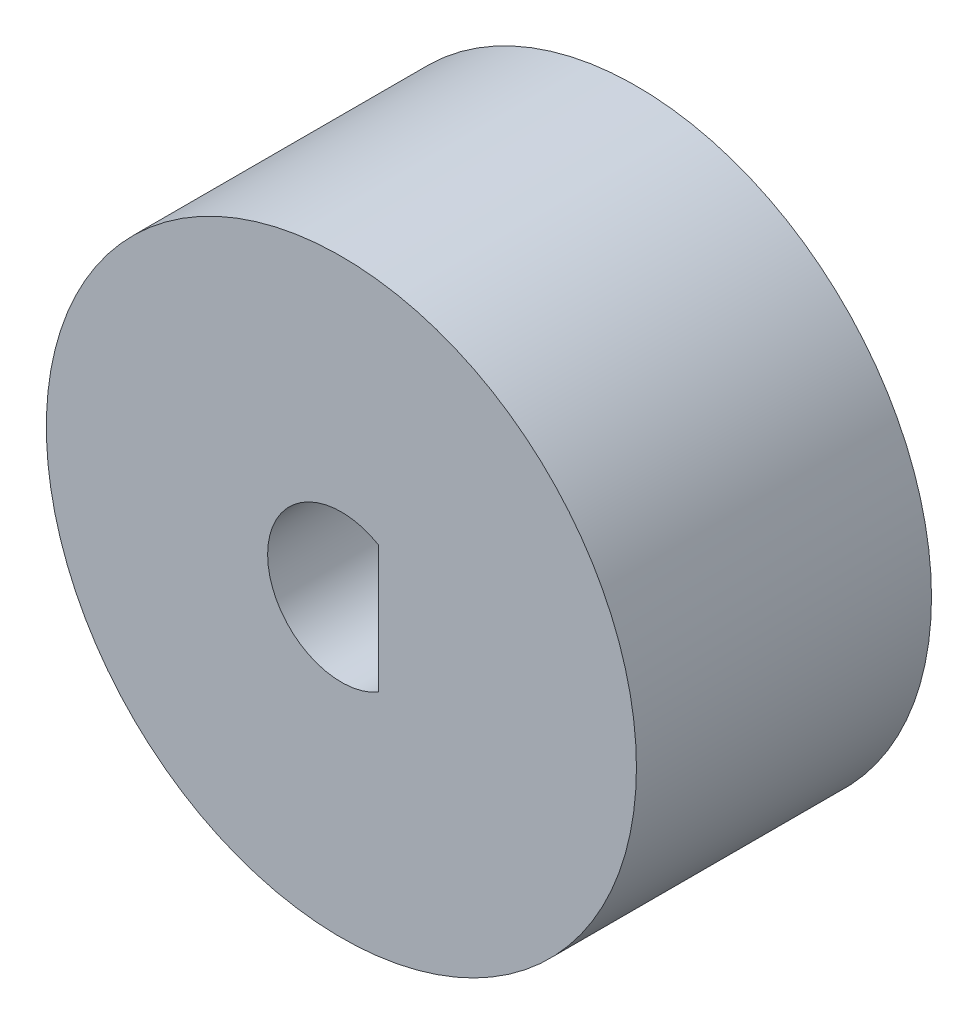
ISO-10303-21;
HEADER;
FILE_DESCRIPTION(('STEP AP214'),'2;1');
FILE_NAME('part.step','',(''),(''),'','','');
FILE_SCHEMA(('AUTOMOTIVE_DESIGN { 1 0 10303 214 1 1 1 1 }'));
ENDSEC;
DATA;
#1=APPLICATION_CONTEXT('core data for automotive mechanical design processes');
#2=APPLICATION_PROTOCOL_DEFINITION('international standard','automotive_design',2000,#1);
#3=PRODUCT_CONTEXT('',#1,'mechanical');
#4=PRODUCT('Part','Part','',(#3));
#5=PRODUCT_RELATED_PRODUCT_CATEGORY('part','',(#4));
#6=PRODUCT_DEFINITION_FORMATION('','',#4);
#7=PRODUCT_DEFINITION_CONTEXT('part definition',#1,'design');
#8=PRODUCT_DEFINITION('design','',#6,#7);
#9=PRODUCT_DEFINITION_SHAPE('','',#8);
#10=(LENGTH_UNIT() NAMED_UNIT(*) SI_UNIT(.MILLI.,.METRE.));
#11=(NAMED_UNIT(*) PLANE_ANGLE_UNIT() SI_UNIT($,.RADIAN.));
#12=(NAMED_UNIT(*) SI_UNIT($,.STERADIAN.) SOLID_ANGLE_UNIT());
#13=UNCERTAINTY_MEASURE_WITH_UNIT(LENGTH_MEASURE(1.E-05),#10,'distance_accuracy_value','');
#14=(GEOMETRIC_REPRESENTATION_CONTEXT(3) GLOBAL_UNCERTAINTY_ASSIGNED_CONTEXT((#13)) GLOBAL_UNIT_ASSIGNED_CONTEXT((#10,
#11,#12)) REPRESENTATION_CONTEXT('',''));
#15=CARTESIAN_POINT('',(0.,0.,0.));
#16=DIRECTION('',(0.,0.,1.));
#17=DIRECTION('',(1.,0.,0.));
#18=AXIS2_PLACEMENT_3D('',#15,#16,#17);
#19=CARTESIAN_POINT('',(0.,0.,50.8));
#20=DIRECTION('',(0.,0.,-1.));
#21=DIRECTION('',(-1.,0.,0.));
#22=AXIS2_PLACEMENT_3D('',#19,#20,#21);
#23=CYLINDRICAL_SURFACE('',#22,12.7);
#24=CARTESIAN_POINT('',(0.,0.,0.));
#25=DIRECTION('',(0.,0.,1.));
#26=DIRECTION('',(1.,0.,0.));
#27=AXIS2_PLACEMENT_3D('',#24,#25,#26);
#28=CIRCLE('',#27,12.7);
#29=CARTESIAN_POINT('',(6.35,10.9985226280624,0.));
#30=VERTEX_POINT('',#29);
#31=CARTESIAN_POINT('',(6.35,-10.9985226280624,0.));
#32=VERTEX_POINT('',#31);
#33=EDGE_CURVE('E63',#30,#32,#28,.T.);
#34=ORIENTED_EDGE('',*,*,#33,.F.);
#35=DIRECTION('',(0.,0.,-1.));
#36=VECTOR('',#35,1.);
#37=CARTESIAN_POINT('',(6.35,10.9985226280624,50.8));
#38=LINE('',#37,#36);
#39=CARTESIAN_POINT('',(6.35,10.9985226280624,50.8));
#40=VERTEX_POINT('',#39);
#41=EDGE_CURVE('E11',#40,#30,#38,.T.);
#42=ORIENTED_EDGE('',*,*,#41,.F.);
#43=CARTESIAN_POINT('',(0.,0.,50.8));
#44=DIRECTION('',(0.,0.,1.));
#45=DIRECTION('',(1.,0.,0.));
#46=AXIS2_PLACEMENT_3D('',#43,#44,#45);
#47=CIRCLE('',#46,12.7);
#48=CARTESIAN_POINT('',(6.35,-10.9985226280624,50.8));
#49=VERTEX_POINT('',#48);
#50=EDGE_CURVE('E64',#40,#49,#47,.T.);
#51=ORIENTED_EDGE('',*,*,#50,.T.);
#52=DIRECTION('',(0.,0.,-1.));
#53=VECTOR('',#52,1.);
#54=CARTESIAN_POINT('',(6.35,-10.9985226280624,50.8));
#55=LINE('',#54,#53);
#56=EDGE_CURVE('E43',#49,#32,#55,.T.);
#57=ORIENTED_EDGE('',*,*,#56,.T.);
#58=EDGE_LOOP('',(#34,#42,#51,#57));
#59=FACE_BOUND('',#58,.T.);
#60=ADVANCED_FACE('F35',(#59),#23,.F.);
#61=CARTESIAN_POINT('',(6.35,0.,50.8));
#62=DIRECTION('',(1.,0.,0.));
#63=DIRECTION('',(0.,0.,-1.));
#64=AXIS2_PLACEMENT_3D('',#61,#62,#63);
#65=PLANE('',#64);
#66=DIRECTION('',(0.,-1.,0.));
#67=VECTOR('',#66,1.);
#68=CARTESIAN_POINT('',(6.35,0.,0.));
#69=LINE('',#68,#67);
#70=EDGE_CURVE('E66',#30,#32,#69,.T.);
#71=ORIENTED_EDGE('',*,*,#70,.T.);
#72=ORIENTED_EDGE('',*,*,#56,.F.);
#73=DIRECTION('',(0.,-1.,0.));
#74=VECTOR('',#73,1.);
#75=CARTESIAN_POINT('',(6.35,0.,50.8));
#76=LINE('',#75,#74);
#77=EDGE_CURVE('E50',#40,#49,#76,.T.);
#78=ORIENTED_EDGE('',*,*,#77,.F.);
#79=ORIENTED_EDGE('',*,*,#41,.T.);
#80=EDGE_LOOP('',(#71,#72,#78,#79));
#81=FACE_BOUND('',#80,.T.);
#82=ADVANCED_FACE('F67',(#81),#65,.F.);
#83=CARTESIAN_POINT('',(0.,0.,50.8));
#84=DIRECTION('',(0.,0.,-1.));
#85=DIRECTION('',(-1.,0.,0.));
#86=AXIS2_PLACEMENT_3D('',#83,#84,#85);
#87=CYLINDRICAL_SURFACE('',#86,50.8);
#88=CARTESIAN_POINT('',(0.,0.,50.8));
#89=DIRECTION('',(0.,0.,1.));
#90=DIRECTION('',(1.,0.,0.));
#91=AXIS2_PLACEMENT_3D('',#88,#89,#90);
#92=CIRCLE('',#91,50.8);
#93=CARTESIAN_POINT('',(50.8,0.,50.8));
#94=VERTEX_POINT('',#93);
#95=EDGE_CURVE('E65',#94,#94,#92,.T.);
#96=ORIENTED_EDGE('',*,*,#95,.F.);
#97=EDGE_LOOP('',(#96));
#98=FACE_BOUND('',#97,.T.);
#99=CARTESIAN_POINT('',(0.,0.,0.));
#100=DIRECTION('',(0.,0.,1.));
#101=DIRECTION('',(1.,0.,0.));
#102=AXIS2_PLACEMENT_3D('',#99,#100,#101);
#103=CIRCLE('',#102,50.8);
#104=CARTESIAN_POINT('',(50.8,0.,0.));
#105=VERTEX_POINT('',#104);
#106=EDGE_CURVE('E69',#105,#105,#103,.T.);
#107=ORIENTED_EDGE('',*,*,#106,.T.);
#108=EDGE_LOOP('',(#107));
#109=FACE_BOUND('',#108,.T.);
#110=ADVANCED_FACE('F86',(#98,#109),#87,.T.);
#111=CARTESIAN_POINT('',(0.,0.,50.8));
#112=DIRECTION('',(0.,0.,1.));
#113=DIRECTION('',(1.,0.,0.));
#114=AXIS2_PLACEMENT_3D('',#111,#112,#113);
#115=PLANE('',#114);
#116=ORIENTED_EDGE('',*,*,#50,.F.);
#117=ORIENTED_EDGE('',*,*,#77,.T.);
#118=EDGE_LOOP('',(#116,#117));
#119=FACE_BOUND('',#118,.T.);
#120=ORIENTED_EDGE('',*,*,#95,.T.);
#121=EDGE_LOOP('',(#120));
#122=FACE_BOUND('',#121,.T.);
#123=ADVANCED_FACE('F84',(#119,#122),#115,.T.);
#124=CARTESIAN_POINT('',(0.,0.,0.));
#125=DIRECTION('',(0.,0.,1.));
#126=DIRECTION('',(1.,0.,0.));
#127=AXIS2_PLACEMENT_3D('',#124,#125,#126);
#128=PLANE('',#127);
#129=ORIENTED_EDGE('',*,*,#33,.T.);
#130=ORIENTED_EDGE('',*,*,#70,.F.);
#131=EDGE_LOOP('',(#129,#130));
#132=FACE_BOUND('',#131,.T.);
#133=ORIENTED_EDGE('',*,*,#106,.F.);
#134=EDGE_LOOP('',(#133));
#135=FACE_BOUND('',#134,.T.);
#136=ADVANCED_FACE('F71',(#132,#135),#128,.F.);
#137=CLOSED_SHELL('',(#60,#82,#110,#123,#136));
#138=MANIFOLD_SOLID_BREP('B2',#137);
#139=ADVANCED_BREP_SHAPE_REPRESENTATION('',(#18,#138),#14);
#140=SHAPE_DEFINITION_REPRESENTATION(#9,#139);
ENDSEC;
END-ISO-10303-21;
